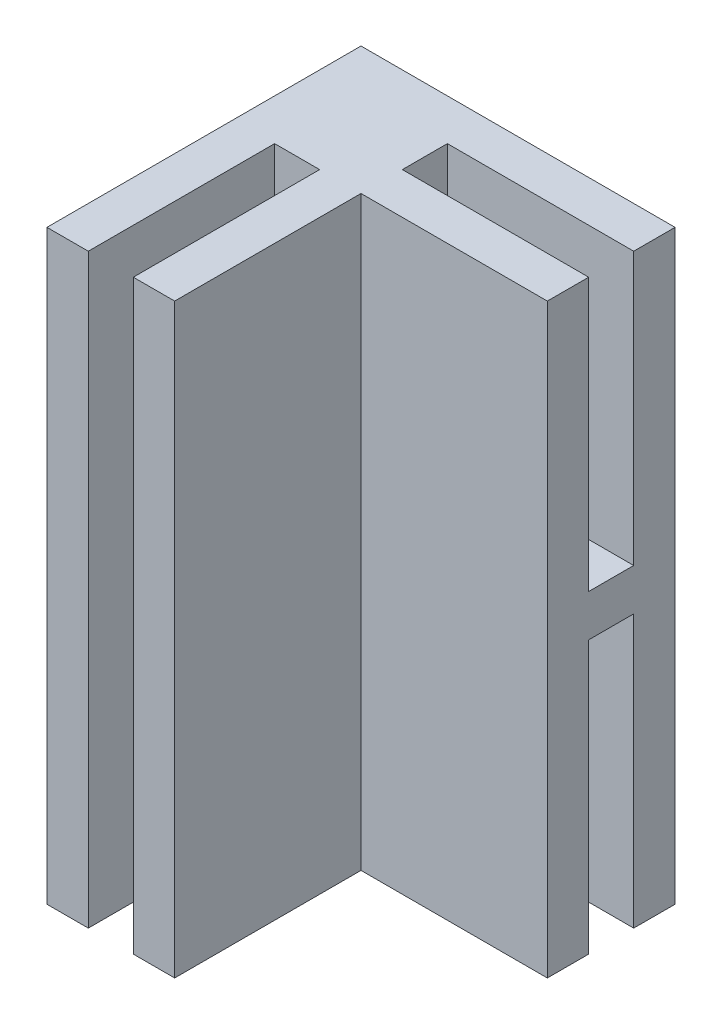
ISO-10303-21;
HEADER;
FILE_DESCRIPTION(('STEP AP214'),'2;1');
FILE_NAME('part.step','',(''),(''),'','','');
FILE_SCHEMA(('AUTOMOTIVE_DESIGN { 1 0 10303 214 1 1 1 1 }'));
ENDSEC;
DATA;
#1=APPLICATION_CONTEXT('core data for automotive mechanical design processes');
#2=APPLICATION_PROTOCOL_DEFINITION('international standard','automotive_design',2000,#1);
#3=PRODUCT_CONTEXT('',#1,'mechanical');
#4=PRODUCT('Part','Part','',(#3));
#5=PRODUCT_RELATED_PRODUCT_CATEGORY('part','',(#4));
#6=PRODUCT_DEFINITION_FORMATION('','',#4);
#7=PRODUCT_DEFINITION_CONTEXT('part definition',#1,'design');
#8=PRODUCT_DEFINITION('design','',#6,#7);
#9=PRODUCT_DEFINITION_SHAPE('','',#8);
#10=(LENGTH_UNIT() NAMED_UNIT(*) SI_UNIT(.MILLI.,.METRE.));
#11=(NAMED_UNIT(*) PLANE_ANGLE_UNIT() SI_UNIT($,.RADIAN.));
#12=(NAMED_UNIT(*) SI_UNIT($,.STERADIAN.) SOLID_ANGLE_UNIT());
#13=UNCERTAINTY_MEASURE_WITH_UNIT(LENGTH_MEASURE(1.E-05),#10,'distance_accuracy_value','');
#14=(GEOMETRIC_REPRESENTATION_CONTEXT(3) GLOBAL_UNCERTAINTY_ASSIGNED_CONTEXT((#13)) GLOBAL_UNIT_ASSIGNED_CONTEXT((#10,
#11,#12)) REPRESENTATION_CONTEXT('',''));
#15=CARTESIAN_POINT('',(0.,0.,0.));
#16=DIRECTION('',(0.,0.,1.));
#17=DIRECTION('',(1.,0.,0.));
#18=AXIS2_PLACEMENT_3D('',#15,#16,#17);
#19=CARTESIAN_POINT('',(-11.3793103448276,56.,20.615763546798));
#20=DIRECTION('',(0.,0.,-1.));
#21=DIRECTION('',(-1.,0.,0.));
#22=AXIS2_PLACEMENT_3D('',#19,#20,#21);
#23=PLANE('',#22);
#24=DIRECTION('',(1.,0.,0.));
#25=VECTOR('',#24,1.);
#26=CARTESIAN_POINT('',(-11.3793103448276,56.,20.615763546798));
#27=LINE('',#26,#25);
#28=CARTESIAN_POINT('',(-3.12931034482758,56.,20.615763546798));
#29=VERTEX_POINT('',#28);
#30=CARTESIAN_POINT('',(0.820689655172419,56.,20.615763546798));
#31=VERTEX_POINT('',#30);
#32=EDGE_CURVE('E305',#29,#31,#27,.T.);
#33=ORIENTED_EDGE('',*,*,#32,.F.);
#34=DIRECTION('',(0.,-1.,0.));
#35=VECTOR('',#34,1.);
#36=CARTESIAN_POINT('',(-3.12931034482758,56.,20.615763546798));
#37=LINE('',#36,#35);
#38=CARTESIAN_POINT('',(-3.12931034482758,0.,20.615763546798));
#39=VERTEX_POINT('',#38);
#40=EDGE_CURVE('E212',#29,#39,#37,.T.);
#41=ORIENTED_EDGE('',*,*,#40,.T.);
#42=DIRECTION('',(1.,0.,0.));
#43=VECTOR('',#42,1.);
#44=CARTESIAN_POINT('',(-11.3793103448276,0.,20.615763546798));
#45=LINE('',#44,#43);
#46=CARTESIAN_POINT('',(0.820689655172419,0.,20.615763546798));
#47=VERTEX_POINT('',#46);
#48=EDGE_CURVE('E322',#39,#47,#45,.T.);
#49=ORIENTED_EDGE('',*,*,#48,.T.);
#50=DIRECTION('',(0.,-1.,0.));
#51=VECTOR('',#50,1.);
#52=CARTESIAN_POINT('',(0.820689655172419,56.,20.615763546798));
#53=LINE('',#52,#51);
#54=EDGE_CURVE('E63',#31,#47,#53,.T.);
#55=ORIENTED_EDGE('',*,*,#54,.F.);
#56=EDGE_LOOP('',(#33,#41,#49,#55));
#57=FACE_BOUND('',#56,.T.);
#58=ADVANCED_FACE('F39',(#57),#23,.F.);
#59=CARTESIAN_POINT('',(-11.3793103448276,56.,-9.38423645320196));
#60=DIRECTION('',(1.,0.,0.));
#61=DIRECTION('',(0.,0.,-1.));
#62=AXIS2_PLACEMENT_3D('',#59,#60,#61);
#63=PLANE('',#62);
#64=DIRECTION('',(0.,0.,1.));
#65=VECTOR('',#64,1.);
#66=CARTESIAN_POINT('',(-11.3793103448276,0.,-9.38423645320196));
#67=LINE('',#66,#65);
#68=CARTESIAN_POINT('',(-11.3793103448276,0.,-9.38423645320196));
#69=VERTEX_POINT('',#68);
#70=CARTESIAN_POINT('',(-11.3793103448276,0.,20.615763546798));
#71=VERTEX_POINT('',#70);
#72=EDGE_CURVE('E291',#69,#71,#67,.T.);
#73=ORIENTED_EDGE('',*,*,#72,.T.);
#74=DIRECTION('',(0.,-1.,0.));
#75=VECTOR('',#74,1.);
#76=CARTESIAN_POINT('',(-11.3793103448276,56.,20.615763546798));
#77=LINE('',#76,#75);
#78=CARTESIAN_POINT('',(-11.3793103448276,56.,20.615763546798));
#79=VERTEX_POINT('',#78);
#80=EDGE_CURVE('E11',#79,#71,#77,.T.);
#81=ORIENTED_EDGE('',*,*,#80,.F.);
#82=DIRECTION('',(0.,0.,1.));
#83=VECTOR('',#82,1.);
#84=CARTESIAN_POINT('',(-11.3793103448276,56.,-9.38423645320196));
#85=LINE('',#84,#83);
#86=CARTESIAN_POINT('',(-11.3793103448276,56.,-9.38423645320196));
#87=VERTEX_POINT('',#86);
#88=EDGE_CURVE('E301',#87,#79,#85,.T.);
#89=ORIENTED_EDGE('',*,*,#88,.F.);
#90=DIRECTION('',(0.,-1.,0.));
#91=VECTOR('',#90,1.);
#92=CARTESIAN_POINT('',(-11.3793103448276,56.,-9.38423645320196));
#93=LINE('',#92,#91);
#94=EDGE_CURVE('E318',#87,#69,#93,.T.);
#95=ORIENTED_EDGE('',*,*,#94,.T.);
#96=EDGE_LOOP('',(#73,#81,#89,#95));
#97=FACE_BOUND('',#96,.T.);
#98=ADVANCED_FACE('F41',(#97),#63,.F.);
#99=CARTESIAN_POINT('',(-7.42931034482758,0.,20.615763546798));
#100=VERTEX_POINT('',#99);
#101=EDGE_CURVE('E323',#71,#100,#45,.T.);
#102=ORIENTED_EDGE('',*,*,#101,.T.);
#103=DIRECTION('',(0.,-1.,0.));
#104=VECTOR('',#103,1.);
#105=CARTESIAN_POINT('',(-7.42931034482758,56.,20.615763546798));
#106=LINE('',#105,#104);
#107=CARTESIAN_POINT('',(-7.42931034482758,56.,20.615763546798));
#108=VERTEX_POINT('',#107);
#109=EDGE_CURVE('E231',#108,#100,#106,.T.);
#110=ORIENTED_EDGE('',*,*,#109,.F.);
#111=EDGE_CURVE('E307',#79,#108,#27,.T.);
#112=ORIENTED_EDGE('',*,*,#111,.F.);
#113=ORIENTED_EDGE('',*,*,#80,.T.);
#114=EDGE_LOOP('',(#102,#110,#112,#113));
#115=FACE_BOUND('',#114,.T.);
#116=ADVANCED_FACE('F409',(#115),#23,.F.);
#117=CARTESIAN_POINT('',(18.6206896551724,56.,-9.38423645320196));
#118=DIRECTION('',(-1.,0.,0.));
#119=DIRECTION('',(0.,0.,1.));
#120=AXIS2_PLACEMENT_3D('',#117,#118,#119);
#121=PLANE('',#120);
#122=DIRECTION('',(0.,0.,-1.));
#123=VECTOR('',#122,1.);
#124=CARTESIAN_POINT('',(18.6206896551724,30.,-5.43423645320196));
#125=LINE('',#124,#123);
#126=CARTESIAN_POINT('',(18.6206896551724,30.,-1.13423645320196));
#127=VERTEX_POINT('',#126);
#128=CARTESIAN_POINT('',(18.6206896551724,30.,-5.43423645320196));
#129=VERTEX_POINT('',#128);
#130=EDGE_CURVE('E174',#127,#129,#125,.T.);
#131=ORIENTED_EDGE('',*,*,#130,.F.);
#132=DIRECTION('',(0.,1.,0.));
#133=VECTOR('',#132,1.);
#134=CARTESIAN_POINT('',(18.6206896551724,30.,-1.13423645320196));
#135=LINE('',#134,#133);
#136=CARTESIAN_POINT('',(18.6206896551724,56.,-1.13423645320196));
#137=VERTEX_POINT('',#136);
#138=EDGE_CURVE('E249',#127,#137,#135,.T.);
#139=ORIENTED_EDGE('',*,*,#138,.T.);
#140=DIRECTION('',(0.,0.,-1.));
#141=VECTOR('',#140,1.);
#142=CARTESIAN_POINT('',(18.6206896551724,56.,-9.38423645320196));
#143=LINE('',#142,#141);
#144=CARTESIAN_POINT('',(18.6206896551724,56.,2.81576354679803));
#145=VERTEX_POINT('',#144);
#146=EDGE_CURVE('E311',#145,#137,#143,.T.);
#147=ORIENTED_EDGE('',*,*,#146,.F.);
#148=DIRECTION('',(0.,-1.,0.));
#149=VECTOR('',#148,1.);
#150=CARTESIAN_POINT('',(18.6206896551724,56.,2.81576354679803));
#151=LINE('',#150,#149);
#152=CARTESIAN_POINT('',(18.6206896551724,0.,2.81576354679803));
#153=VERTEX_POINT('',#152);
#154=EDGE_CURVE('E217',#145,#153,#151,.T.);
#155=ORIENTED_EDGE('',*,*,#154,.T.);
#156=DIRECTION('',(0.,0.,-1.));
#157=VECTOR('',#156,1.);
#158=CARTESIAN_POINT('',(18.6206896551724,0.,-9.38423645320196));
#159=LINE('',#158,#157);
#160=CARTESIAN_POINT('',(18.6206896551724,0.,-1.13423645320196));
#161=VERTEX_POINT('',#160);
#162=EDGE_CURVE('E328',#153,#161,#159,.T.);
#163=ORIENTED_EDGE('',*,*,#162,.T.);
#164=DIRECTION('',(0.,-1.,0.));
#165=VECTOR('',#164,1.);
#166=CARTESIAN_POINT('',(18.6206896551724,26.,-1.13423645320196));
#167=LINE('',#166,#165);
#168=CARTESIAN_POINT('',(18.6206896551724,26.,-1.13423645320196));
#169=VERTEX_POINT('',#168);
#170=EDGE_CURVE('E277',#169,#161,#167,.T.);
#171=ORIENTED_EDGE('',*,*,#170,.F.);
#172=DIRECTION('',(0.,0.,1.));
#173=VECTOR('',#172,1.);
#174=CARTESIAN_POINT('',(18.6206896551724,26.,-5.43423645320196));
#175=LINE('',#174,#173);
#176=CARTESIAN_POINT('',(18.6206896551724,26.,-5.43423645320196));
#177=VERTEX_POINT('',#176);
#178=EDGE_CURVE('E260',#177,#169,#175,.T.);
#179=ORIENTED_EDGE('',*,*,#178,.F.);
#180=DIRECTION('',(0.,-1.,0.));
#181=VECTOR('',#180,1.);
#182=CARTESIAN_POINT('',(18.6206896551724,26.,-5.43423645320196));
#183=LINE('',#182,#181);
#184=CARTESIAN_POINT('',(18.6206896551724,0.,-5.43423645320196));
#185=VERTEX_POINT('',#184);
#186=EDGE_CURVE('E287',#177,#185,#183,.T.);
#187=ORIENTED_EDGE('',*,*,#186,.T.);
#188=CARTESIAN_POINT('',(18.6206896551724,0.,-9.38423645320196));
#189=VERTEX_POINT('',#188);
#190=EDGE_CURVE('E327',#185,#189,#159,.T.);
#191=ORIENTED_EDGE('',*,*,#190,.T.);
#192=DIRECTION('',(0.,-1.,0.));
#193=VECTOR('',#192,1.);
#194=CARTESIAN_POINT('',(18.6206896551724,56.,-9.38423645320196));
#195=LINE('',#194,#193);
#196=CARTESIAN_POINT('',(18.6206896551724,56.,-9.38423645320196));
#197=VERTEX_POINT('',#196);
#198=EDGE_CURVE('E48',#197,#189,#195,.T.);
#199=ORIENTED_EDGE('',*,*,#198,.F.);
#200=CARTESIAN_POINT('',(18.6206896551724,56.,-5.43423645320196));
#201=VERTEX_POINT('',#200);
#202=EDGE_CURVE('E189',#201,#197,#143,.T.);
#203=ORIENTED_EDGE('',*,*,#202,.F.);
#204=DIRECTION('',(0.,1.,0.));
#205=VECTOR('',#204,1.);
#206=CARTESIAN_POINT('',(18.6206896551724,30.,-5.43423645320196));
#207=LINE('',#206,#205);
#208=EDGE_CURVE('E55',#129,#201,#207,.T.);
#209=ORIENTED_EDGE('',*,*,#208,.F.);
#210=EDGE_LOOP('',(#131,#139,#147,#155,#163,#171,#179,#187,#191,#199,#203,#209));
#211=FACE_BOUND('',#210,.T.);
#212=ADVANCED_FACE('F187',(#211),#121,.F.);
#213=CARTESIAN_POINT('',(-11.3793103448276,56.,-9.38423645320196));
#214=DIRECTION('',(0.,0.,1.));
#215=DIRECTION('',(1.,0.,0.));
#216=AXIS2_PLACEMENT_3D('',#213,#214,#215);
#217=PLANE('',#216);
#218=DIRECTION('',(-1.,0.,0.));
#219=VECTOR('',#218,1.);
#220=CARTESIAN_POINT('',(-11.3793103448276,0.,-9.38423645320196));
#221=LINE('',#220,#219);
#222=EDGE_CURVE('E306',#189,#69,#221,.T.);
#223=ORIENTED_EDGE('',*,*,#222,.T.);
#224=ORIENTED_EDGE('',*,*,#94,.F.);
#225=DIRECTION('',(-1.,0.,0.));
#226=VECTOR('',#225,1.);
#227=CARTESIAN_POINT('',(-11.3793103448276,56.,-9.38423645320196));
#228=LINE('',#227,#226);
#229=EDGE_CURVE('E315',#197,#87,#228,.T.);
#230=ORIENTED_EDGE('',*,*,#229,.F.);
#231=ORIENTED_EDGE('',*,*,#198,.T.);
#232=EDGE_LOOP('',(#223,#224,#230,#231));
#233=FACE_BOUND('',#232,.T.);
#234=ADVANCED_FACE('F340',(#233),#217,.F.);
#235=CARTESIAN_POINT('',(0.,56.,0.));
#236=DIRECTION('',(0.,1.,0.));
#237=DIRECTION('',(0.,0.,1.));
#238=AXIS2_PLACEMENT_3D('',#235,#236,#237);
#239=PLANE('',#238);
#240=DIRECTION('',(1.,0.,0.));
#241=VECTOR('',#240,1.);
#242=CARTESIAN_POINT('',(18.6206896551724,56.,-1.13423645320196));
#243=LINE('',#242,#241);
#244=CARTESIAN_POINT('',(0.820689655172419,56.,-1.13423645320196));
#245=VERTEX_POINT('',#244);
#246=EDGE_CURVE('E184',#245,#137,#243,.T.);
#247=ORIENTED_EDGE('',*,*,#246,.F.);
#248=DIRECTION('',(0.,0.,1.));
#249=VECTOR('',#248,1.);
#250=CARTESIAN_POINT('',(0.820689655172419,56.,-5.43423645320196));
#251=LINE('',#250,#249);
#252=CARTESIAN_POINT('',(0.820689655172419,56.,-5.43423645320196));
#253=VERTEX_POINT('',#252);
#254=EDGE_CURVE('E371',#253,#245,#251,.T.);
#255=ORIENTED_EDGE('',*,*,#254,.F.);
#256=DIRECTION('',(-1.,0.,0.));
#257=VECTOR('',#256,1.);
#258=CARTESIAN_POINT('',(18.6206896551724,56.,-5.43423645320196));
#259=LINE('',#258,#257);
#260=EDGE_CURVE('E356',#201,#253,#259,.T.);
#261=ORIENTED_EDGE('',*,*,#260,.F.);
#262=ORIENTED_EDGE('',*,*,#202,.T.);
#263=ORIENTED_EDGE('',*,*,#229,.T.);
#264=ORIENTED_EDGE('',*,*,#88,.T.);
#265=ORIENTED_EDGE('',*,*,#111,.T.);
#266=DIRECTION('',(0.,0.,-1.));
#267=VECTOR('',#266,1.);
#268=CARTESIAN_POINT('',(-7.42931034482758,56.,20.615763546798));
#269=LINE('',#268,#267);
#270=CARTESIAN_POINT('',(-7.42931034482758,56.,2.81576354679803));
#271=VERTEX_POINT('',#270);
#272=EDGE_CURVE('E203',#108,#271,#269,.T.);
#273=ORIENTED_EDGE('',*,*,#272,.T.);
#274=DIRECTION('',(1.,0.,0.));
#275=VECTOR('',#274,1.);
#276=CARTESIAN_POINT('',(-3.12931034482758,56.,2.81576354679803));
#277=LINE('',#276,#275);
#278=CARTESIAN_POINT('',(-3.12931034482758,56.,2.81576354679803));
#279=VERTEX_POINT('',#278);
#280=EDGE_CURVE('E208',#271,#279,#277,.T.);
#281=ORIENTED_EDGE('',*,*,#280,.T.);
#282=DIRECTION('',(0.,0.,1.));
#283=VECTOR('',#282,1.);
#284=CARTESIAN_POINT('',(-3.12931034482758,56.,20.615763546798));
#285=LINE('',#284,#283);
#286=EDGE_CURVE('E199',#279,#29,#285,.T.);
#287=ORIENTED_EDGE('',*,*,#286,.T.);
#288=ORIENTED_EDGE('',*,*,#32,.T.);
#289=DIRECTION('',(0.,0.,-1.));
#290=VECTOR('',#289,1.);
#291=CARTESIAN_POINT('',(0.820689655172419,56.,20.615763546798));
#292=LINE('',#291,#290);
#293=CARTESIAN_POINT('',(0.820689655172421,56.,2.81576354679803));
#294=VERTEX_POINT('',#293);
#295=EDGE_CURVE('E237',#31,#294,#292,.T.);
#296=ORIENTED_EDGE('',*,*,#295,.T.);
#297=DIRECTION('',(1.,0.,0.));
#298=VECTOR('',#297,1.);
#299=CARTESIAN_POINT('',(18.6206896551724,56.,2.81576354679803));
#300=LINE('',#299,#298);
#301=EDGE_CURVE('E241',#294,#145,#300,.T.);
#302=ORIENTED_EDGE('',*,*,#301,.T.);
#303=ORIENTED_EDGE('',*,*,#146,.T.);
#304=EDGE_LOOP('',(#247,#255,#261,#262,#263,#264,#265,#273,#281,#287,#288,#296,#302,#303));
#305=FACE_BOUND('',#304,.T.);
#306=ADVANCED_FACE('F354',(#305),#239,.T.);
#307=CARTESIAN_POINT('',(0.,0.,0.));
#308=DIRECTION('',(0.,1.,0.));
#309=DIRECTION('',(0.,0.,1.));
#310=AXIS2_PLACEMENT_3D('',#307,#308,#309);
#311=PLANE('',#310);
#312=ORIENTED_EDGE('',*,*,#48,.F.);
#313=DIRECTION('',(0.,0.,1.));
#314=VECTOR('',#313,1.);
#315=CARTESIAN_POINT('',(-3.12931034482758,0.,20.615763546798));
#316=LINE('',#315,#314);
#317=CARTESIAN_POINT('',(-3.12931034482758,0.,2.81576354679803));
#318=VERTEX_POINT('',#317);
#319=EDGE_CURVE('E213',#318,#39,#316,.T.);
#320=ORIENTED_EDGE('',*,*,#319,.F.);
#321=DIRECTION('',(1.,0.,0.));
#322=VECTOR('',#321,1.);
#323=CARTESIAN_POINT('',(-3.12931034482758,0.,2.81576354679803));
#324=LINE('',#323,#322);
#325=CARTESIAN_POINT('',(-7.42931034482758,0.,2.81576354679803));
#326=VERTEX_POINT('',#325);
#327=EDGE_CURVE('E204',#326,#318,#324,.T.);
#328=ORIENTED_EDGE('',*,*,#327,.F.);
#329=DIRECTION('',(0.,0.,-1.));
#330=VECTOR('',#329,1.);
#331=CARTESIAN_POINT('',(-7.42931034482758,0.,20.615763546798));
#332=LINE('',#331,#330);
#333=EDGE_CURVE('E216',#100,#326,#332,.T.);
#334=ORIENTED_EDGE('',*,*,#333,.F.);
#335=ORIENTED_EDGE('',*,*,#101,.F.);
#336=ORIENTED_EDGE('',*,*,#72,.F.);
#337=ORIENTED_EDGE('',*,*,#222,.F.);
#338=ORIENTED_EDGE('',*,*,#190,.F.);
#339=DIRECTION('',(1.,0.,0.));
#340=VECTOR('',#339,1.);
#341=CARTESIAN_POINT('',(18.6206896551724,0.,-5.43423645320196));
#342=LINE('',#341,#340);
#343=CARTESIAN_POINT('',(0.820689655172419,0.,-5.43423645320197));
#344=VERTEX_POINT('',#343);
#345=EDGE_CURVE('E265',#344,#185,#342,.T.);
#346=ORIENTED_EDGE('',*,*,#345,.F.);
#347=DIRECTION('',(0.,0.,-1.));
#348=VECTOR('',#347,1.);
#349=CARTESIAN_POINT('',(0.820689655172419,0.,-5.43423645320197));
#350=LINE('',#349,#348);
#351=CARTESIAN_POINT('',(0.820689655172419,0.,-1.13423645320196));
#352=VERTEX_POINT('',#351);
#353=EDGE_CURVE('E281',#352,#344,#350,.T.);
#354=ORIENTED_EDGE('',*,*,#353,.F.);
#355=DIRECTION('',(-1.,0.,0.));
#356=VECTOR('',#355,1.);
#357=CARTESIAN_POINT('',(18.6206896551724,0.,-1.13423645320196));
#358=LINE('',#357,#356);
#359=EDGE_CURVE('E227',#161,#352,#358,.T.);
#360=ORIENTED_EDGE('',*,*,#359,.F.);
#361=ORIENTED_EDGE('',*,*,#162,.F.);
#362=DIRECTION('',(1.,0.,0.));
#363=VECTOR('',#362,1.);
#364=CARTESIAN_POINT('',(18.6206896551724,0.,2.81576354679803));
#365=LINE('',#364,#363);
#366=CARTESIAN_POINT('',(0.820689655172421,0.,2.81576354679803));
#367=VERTEX_POINT('',#366);
#368=EDGE_CURVE('E242',#367,#153,#365,.T.);
#369=ORIENTED_EDGE('',*,*,#368,.F.);
#370=DIRECTION('',(0.,0.,-1.));
#371=VECTOR('',#370,1.);
#372=CARTESIAN_POINT('',(0.820689655172419,0.,20.615763546798));
#373=LINE('',#372,#371);
#374=EDGE_CURVE('E246',#47,#367,#373,.T.);
#375=ORIENTED_EDGE('',*,*,#374,.F.);
#376=EDGE_LOOP('',(#312,#320,#328,#334,#335,#336,#337,#338,#346,#354,#360,#361,#369,#375));
#377=FACE_BOUND('',#376,.T.);
#378=ADVANCED_FACE('F346',(#377),#311,.F.);
#379=CARTESIAN_POINT('',(18.6206896551724,26.,-5.43423645320196));
#380=DIRECTION('',(0.,0.,-1.));
#381=DIRECTION('',(-1.,0.,0.));
#382=AXIS2_PLACEMENT_3D('',#379,#380,#381);
#383=PLANE('',#382);
#384=ORIENTED_EDGE('',*,*,#345,.T.);
#385=ORIENTED_EDGE('',*,*,#186,.F.);
#386=DIRECTION('',(1.,0.,0.));
#387=VECTOR('',#386,1.);
#388=CARTESIAN_POINT('',(18.6206896551724,26.,-5.43423645320196));
#389=LINE('',#388,#387);
#390=CARTESIAN_POINT('',(0.820689655172419,26.,-5.43423645320197));
#391=VERTEX_POINT('',#390);
#392=EDGE_CURVE('E273',#391,#177,#389,.T.);
#393=ORIENTED_EDGE('',*,*,#392,.F.);
#394=DIRECTION('',(0.,-1.,0.));
#395=VECTOR('',#394,1.);
#396=CARTESIAN_POINT('',(0.820689655172419,26.,-5.43423645320197));
#397=LINE('',#396,#395);
#398=EDGE_CURVE('E292',#391,#344,#397,.T.);
#399=ORIENTED_EDGE('',*,*,#398,.T.);
#400=EDGE_LOOP('',(#384,#385,#393,#399));
#401=FACE_BOUND('',#400,.T.);
#402=ADVANCED_FACE('F396',(#401),#383,.F.);
#403=CARTESIAN_POINT('',(0.820689655172419,26.,-5.43423645320197));
#404=DIRECTION('',(-1.,0.,0.));
#405=DIRECTION('',(0.,0.,1.));
#406=AXIS2_PLACEMENT_3D('',#403,#404,#405);
#407=PLANE('',#406);
#408=ORIENTED_EDGE('',*,*,#353,.T.);
#409=ORIENTED_EDGE('',*,*,#398,.F.);
#410=DIRECTION('',(0.,0.,-1.));
#411=VECTOR('',#410,1.);
#412=CARTESIAN_POINT('',(0.820689655172419,26.,-5.43423645320197));
#413=LINE('',#412,#411);
#414=CARTESIAN_POINT('',(0.820689655172419,26.,-1.13423645320196));
#415=VERTEX_POINT('',#414);
#416=EDGE_CURVE('E269',#415,#391,#413,.T.);
#417=ORIENTED_EDGE('',*,*,#416,.F.);
#418=DIRECTION('',(0.,-1.,0.));
#419=VECTOR('',#418,1.);
#420=CARTESIAN_POINT('',(0.820689655172419,26.,-1.13423645320196));
#421=LINE('',#420,#419);
#422=EDGE_CURVE('E295',#415,#352,#421,.T.);
#423=ORIENTED_EDGE('',*,*,#422,.T.);
#424=EDGE_LOOP('',(#408,#409,#417,#423));
#425=FACE_BOUND('',#424,.T.);
#426=ADVANCED_FACE('F398',(#425),#407,.F.);
#427=CARTESIAN_POINT('',(18.6206896551724,26.,-1.13423645320196));
#428=DIRECTION('',(0.,0.,1.));
#429=DIRECTION('',(1.,0.,0.));
#430=AXIS2_PLACEMENT_3D('',#427,#428,#429);
#431=PLANE('',#430);
#432=ORIENTED_EDGE('',*,*,#359,.T.);
#433=ORIENTED_EDGE('',*,*,#422,.F.);
#434=DIRECTION('',(-1.,0.,0.));
#435=VECTOR('',#434,1.);
#436=CARTESIAN_POINT('',(18.6206896551724,26.,-1.13423645320196));
#437=LINE('',#436,#435);
#438=EDGE_CURVE('E264',#169,#415,#437,.T.);
#439=ORIENTED_EDGE('',*,*,#438,.F.);
#440=ORIENTED_EDGE('',*,*,#170,.T.);
#441=EDGE_LOOP('',(#432,#433,#439,#440));
#442=FACE_BOUND('',#441,.T.);
#443=ADVANCED_FACE('F389',(#442),#431,.F.);
#444=CARTESIAN_POINT('',(0.,26.,0.));
#445=DIRECTION('',(0.,-1.,0.));
#446=DIRECTION('',(0.,0.,-1.));
#447=AXIS2_PLACEMENT_3D('',#444,#445,#446);
#448=PLANE('',#447);
#449=ORIENTED_EDGE('',*,*,#178,.T.);
#450=ORIENTED_EDGE('',*,*,#438,.T.);
#451=ORIENTED_EDGE('',*,*,#416,.T.);
#452=ORIENTED_EDGE('',*,*,#392,.T.);
#453=EDGE_LOOP('',(#449,#450,#451,#452));
#454=FACE_BOUND('',#453,.T.);
#455=ADVANCED_FACE('F393',(#454),#448,.T.);
#456=CARTESIAN_POINT('',(18.6206896551724,56.,2.81576354679803));
#457=DIRECTION('',(0.,0.,-1.));
#458=DIRECTION('',(-1.,0.,0.));
#459=AXIS2_PLACEMENT_3D('',#456,#457,#458);
#460=PLANE('',#459);
#461=ORIENTED_EDGE('',*,*,#368,.T.);
#462=ORIENTED_EDGE('',*,*,#154,.F.);
#463=ORIENTED_EDGE('',*,*,#301,.F.);
#464=DIRECTION('',(0.,-1.,0.));
#465=VECTOR('',#464,1.);
#466=CARTESIAN_POINT('',(0.820689655172421,56.,2.81576354679803));
#467=LINE('',#466,#465);
#468=EDGE_CURVE('E255',#294,#367,#467,.T.);
#469=ORIENTED_EDGE('',*,*,#468,.T.);
#470=EDGE_LOOP('',(#461,#462,#463,#469));
#471=FACE_BOUND('',#470,.T.);
#472=ADVANCED_FACE('F382',(#471),#460,.F.);
#473=CARTESIAN_POINT('',(0.820689655172419,56.,20.615763546798));
#474=DIRECTION('',(-1.,0.,0.));
#475=DIRECTION('',(0.,0.,1.));
#476=AXIS2_PLACEMENT_3D('',#473,#474,#475);
#477=PLANE('',#476);
#478=ORIENTED_EDGE('',*,*,#374,.T.);
#479=ORIENTED_EDGE('',*,*,#468,.F.);
#480=ORIENTED_EDGE('',*,*,#295,.F.);
#481=ORIENTED_EDGE('',*,*,#54,.T.);
#482=EDGE_LOOP('',(#478,#479,#480,#481));
#483=FACE_BOUND('',#482,.T.);
#484=ADVANCED_FACE('F430',(#483),#477,.F.);
#485=CARTESIAN_POINT('',(-3.12931034482758,56.,20.615763546798));
#486=DIRECTION('',(1.,0.,0.));
#487=DIRECTION('',(0.,0.,-1.));
#488=AXIS2_PLACEMENT_3D('',#485,#486,#487);
#489=PLANE('',#488);
#490=ORIENTED_EDGE('',*,*,#319,.T.);
#491=ORIENTED_EDGE('',*,*,#40,.F.);
#492=ORIENTED_EDGE('',*,*,#286,.F.);
#493=DIRECTION('',(0.,-1.,0.));
#494=VECTOR('',#493,1.);
#495=CARTESIAN_POINT('',(-3.12931034482758,56.,2.81576354679803));
#496=LINE('',#495,#494);
#497=EDGE_CURVE('E224',#279,#318,#496,.T.);
#498=ORIENTED_EDGE('',*,*,#497,.T.);
#499=EDGE_LOOP('',(#490,#491,#492,#498));
#500=FACE_BOUND('',#499,.T.);
#501=ADVANCED_FACE('F432',(#500),#489,.F.);
#502=CARTESIAN_POINT('',(-3.12931034482758,56.,2.81576354679803));
#503=DIRECTION('',(0.,0.,-1.));
#504=DIRECTION('',(-1.,0.,0.));
#505=AXIS2_PLACEMENT_3D('',#502,#503,#504);
#506=PLANE('',#505);
#507=ORIENTED_EDGE('',*,*,#327,.T.);
#508=ORIENTED_EDGE('',*,*,#497,.F.);
#509=ORIENTED_EDGE('',*,*,#280,.F.);
#510=DIRECTION('',(0.,-1.,0.));
#511=VECTOR('',#510,1.);
#512=CARTESIAN_POINT('',(-7.42931034482758,56.,2.81576354679803));
#513=LINE('',#512,#511);
#514=EDGE_CURVE('E228',#271,#326,#513,.T.);
#515=ORIENTED_EDGE('',*,*,#514,.T.);
#516=EDGE_LOOP('',(#507,#508,#509,#515));
#517=FACE_BOUND('',#516,.T.);
#518=ADVANCED_FACE('F426',(#517),#506,.F.);
#519=CARTESIAN_POINT('',(-7.42931034482758,56.,20.615763546798));
#520=DIRECTION('',(-1.,0.,0.));
#521=DIRECTION('',(0.,0.,1.));
#522=AXIS2_PLACEMENT_3D('',#519,#520,#521);
#523=PLANE('',#522);
#524=ORIENTED_EDGE('',*,*,#333,.T.);
#525=ORIENTED_EDGE('',*,*,#514,.F.);
#526=ORIENTED_EDGE('',*,*,#272,.F.);
#527=ORIENTED_EDGE('',*,*,#109,.T.);
#528=EDGE_LOOP('',(#524,#525,#526,#527));
#529=FACE_BOUND('',#528,.T.);
#530=ADVANCED_FACE('F422',(#529),#523,.F.);
#531=CARTESIAN_POINT('',(18.6206896551724,30.,-1.13423645320196));
#532=DIRECTION('',(0.,0.,1.));
#533=DIRECTION('',(1.,0.,0.));
#534=AXIS2_PLACEMENT_3D('',#531,#532,#533);
#535=PLANE('',#534);
#536=ORIENTED_EDGE('',*,*,#246,.T.);
#537=ORIENTED_EDGE('',*,*,#138,.F.);
#538=DIRECTION('',(1.,0.,0.));
#539=VECTOR('',#538,1.);
#540=CARTESIAN_POINT('',(18.6206896551724,30.,-1.13423645320196));
#541=LINE('',#540,#539);
#542=CARTESIAN_POINT('',(0.820689655172419,30.,-1.13423645320196));
#543=VERTEX_POINT('',#542);
#544=EDGE_CURVE('E180',#543,#127,#541,.T.);
#545=ORIENTED_EDGE('',*,*,#544,.F.);
#546=DIRECTION('',(0.,1.,0.));
#547=VECTOR('',#546,1.);
#548=CARTESIAN_POINT('',(0.820689655172419,30.,-1.13423645320196));
#549=LINE('',#548,#547);
#550=EDGE_CURVE('E194',#543,#245,#549,.T.);
#551=ORIENTED_EDGE('',*,*,#550,.T.);
#552=EDGE_LOOP('',(#536,#537,#545,#551));
#553=FACE_BOUND('',#552,.T.);
#554=ADVANCED_FACE('F378',(#553),#535,.F.);
#555=CARTESIAN_POINT('',(0.820689655172419,30.,-5.43423645320196));
#556=DIRECTION('',(-1.,0.,0.));
#557=DIRECTION('',(0.,0.,1.));
#558=AXIS2_PLACEMENT_3D('',#555,#556,#557);
#559=PLANE('',#558);
#560=ORIENTED_EDGE('',*,*,#254,.T.);
#561=ORIENTED_EDGE('',*,*,#550,.F.);
#562=DIRECTION('',(0.,0.,1.));
#563=VECTOR('',#562,1.);
#564=CARTESIAN_POINT('',(0.820689655172419,30.,-5.43423645320196));
#565=LINE('',#564,#563);
#566=CARTESIAN_POINT('',(0.820689655172419,30.,-5.43423645320196));
#567=VERTEX_POINT('',#566);
#568=EDGE_CURVE('E173',#567,#543,#565,.T.);
#569=ORIENTED_EDGE('',*,*,#568,.F.);
#570=DIRECTION('',(0.,1.,0.));
#571=VECTOR('',#570,1.);
#572=CARTESIAN_POINT('',(0.820689655172419,30.,-5.43423645320196));
#573=LINE('',#572,#571);
#574=EDGE_CURVE('E168',#567,#253,#573,.T.);
#575=ORIENTED_EDGE('',*,*,#574,.T.);
#576=EDGE_LOOP('',(#560,#561,#569,#575));
#577=FACE_BOUND('',#576,.T.);
#578=ADVANCED_FACE('F507',(#577),#559,.F.);
#579=CARTESIAN_POINT('',(18.6206896551724,30.,-5.43423645320196));
#580=DIRECTION('',(0.,0.,-1.));
#581=DIRECTION('',(-1.,0.,0.));
#582=AXIS2_PLACEMENT_3D('',#579,#580,#581);
#583=PLANE('',#582);
#584=ORIENTED_EDGE('',*,*,#260,.T.);
#585=ORIENTED_EDGE('',*,*,#574,.F.);
#586=DIRECTION('',(-1.,0.,0.));
#587=VECTOR('',#586,1.);
#588=CARTESIAN_POINT('',(18.6206896551724,30.,-5.43423645320196));
#589=LINE('',#588,#587);
#590=EDGE_CURVE('E165',#129,#567,#589,.T.);
#591=ORIENTED_EDGE('',*,*,#590,.F.);
#592=ORIENTED_EDGE('',*,*,#208,.T.);
#593=EDGE_LOOP('',(#584,#585,#591,#592));
#594=FACE_BOUND('',#593,.T.);
#595=ADVANCED_FACE('F167',(#594),#583,.F.);
#596=CARTESIAN_POINT('',(0.,30.,0.));
#597=DIRECTION('',(0.,-1.,0.));
#598=DIRECTION('',(0.,0.,-1.));
#599=AXIS2_PLACEMENT_3D('',#596,#597,#598);
#600=PLANE('',#599);
#601=ORIENTED_EDGE('',*,*,#130,.T.);
#602=ORIENTED_EDGE('',*,*,#590,.T.);
#603=ORIENTED_EDGE('',*,*,#568,.T.);
#604=ORIENTED_EDGE('',*,*,#544,.T.);
#605=EDGE_LOOP('',(#601,#602,#603,#604));
#606=FACE_BOUND('',#605,.T.);
#607=ADVANCED_FACE('F178',(#606),#600,.F.);
#608=CLOSED_SHELL('',(#58,#98,#116,#212,#234,#306,#378,#402,#426,#443,#455,#472,#484,#501,#518,
#530,#554,#578,#595,#607));
#609=MANIFOLD_SOLID_BREP('B2',#608);
#610=ADVANCED_BREP_SHAPE_REPRESENTATION('',(#18,#609),#14);
#611=SHAPE_DEFINITION_REPRESENTATION(#9,#610);
ENDSEC;
END-ISO-10303-21;
